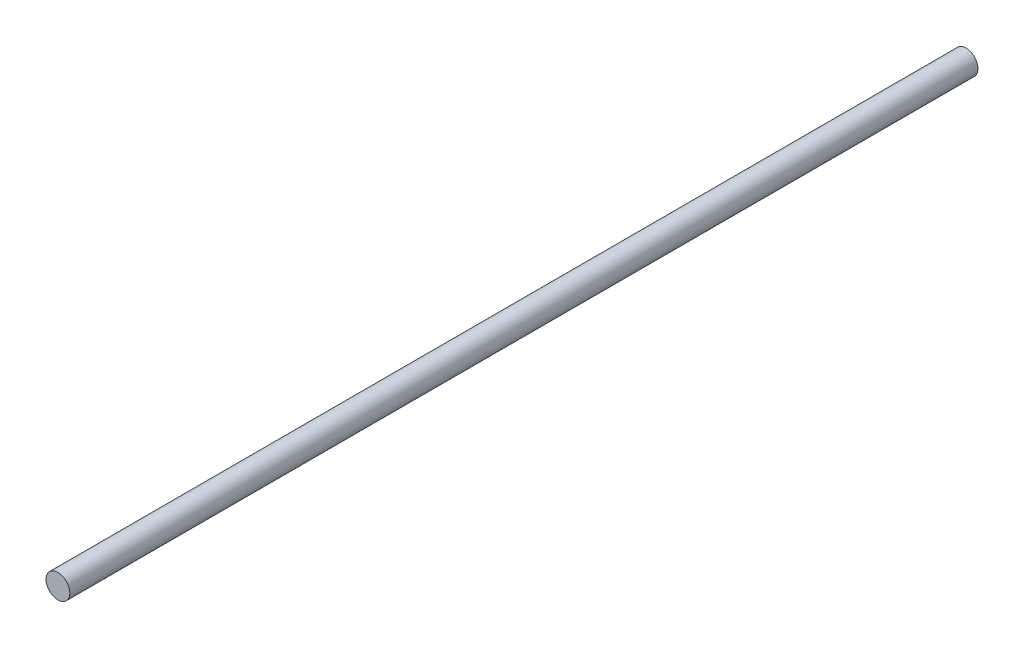
ISO-10303-21;
HEADER;
FILE_DESCRIPTION(('STEP AP214'),'2;1');
FILE_NAME('part.step','',(''),(''),'','','');
FILE_SCHEMA(('AUTOMOTIVE_DESIGN { 1 0 10303 214 1 1 1 1 }'));
ENDSEC;
DATA;
#1=APPLICATION_CONTEXT('core data for automotive mechanical design processes');
#2=APPLICATION_PROTOCOL_DEFINITION('international standard','automotive_design',2000,#1);
#3=PRODUCT_CONTEXT('',#1,'mechanical');
#4=PRODUCT('Part','Part','',(#3));
#5=PRODUCT_RELATED_PRODUCT_CATEGORY('part','',(#4));
#6=PRODUCT_DEFINITION_FORMATION('','',#4);
#7=PRODUCT_DEFINITION_CONTEXT('part definition',#1,'design');
#8=PRODUCT_DEFINITION('design','',#6,#7);
#9=PRODUCT_DEFINITION_SHAPE('','',#8);
#10=(LENGTH_UNIT() NAMED_UNIT(*) SI_UNIT(.MILLI.,.METRE.));
#11=(NAMED_UNIT(*) PLANE_ANGLE_UNIT() SI_UNIT($,.RADIAN.));
#12=(NAMED_UNIT(*) SI_UNIT($,.STERADIAN.) SOLID_ANGLE_UNIT());
#13=UNCERTAINTY_MEASURE_WITH_UNIT(LENGTH_MEASURE(1.E-05),#10,'distance_accuracy_value','');
#14=(GEOMETRIC_REPRESENTATION_CONTEXT(3) GLOBAL_UNCERTAINTY_ASSIGNED_CONTEXT((#13)) GLOBAL_UNIT_ASSIGNED_CONTEXT((#10,
#11,#12)) REPRESENTATION_CONTEXT('',''));
#15=CARTESIAN_POINT('',(0.,0.,0.));
#16=DIRECTION('',(0.,0.,1.));
#17=DIRECTION('',(1.,0.,0.));
#18=AXIS2_PLACEMENT_3D('',#15,#16,#17);
#19=CARTESIAN_POINT('',(0.,0.,23.8125));
#20=DIRECTION('',(0.,0.,-1.));
#21=DIRECTION('',(-1.,0.,0.));
#22=AXIS2_PLACEMENT_3D('',#19,#20,#21);
#23=CYLINDRICAL_SURFACE('',#22,0.625);
#24=CARTESIAN_POINT('',(0.,0.,23.8125));
#25=DIRECTION('',(0.,0.,1.));
#26=DIRECTION('',(1.,0.,0.));
#27=AXIS2_PLACEMENT_3D('',#24,#25,#26);
#28=CIRCLE('',#27,0.625);
#29=CARTESIAN_POINT('',(0.625,0.,23.8125));
#30=VERTEX_POINT('',#29);
#31=EDGE_CURVE('E10',#30,#30,#28,.T.);
#32=ORIENTED_EDGE('',*,*,#31,.F.);
#33=EDGE_LOOP('',(#32));
#34=FACE_BOUND('',#33,.T.);
#35=CARTESIAN_POINT('',(0.,0.,-23.8125));
#36=DIRECTION('',(0.,0.,1.));
#37=DIRECTION('',(1.,0.,0.));
#38=AXIS2_PLACEMENT_3D('',#35,#36,#37);
#39=CIRCLE('',#38,0.625);
#40=CARTESIAN_POINT('',(0.625,0.,-23.8125));
#41=VERTEX_POINT('',#40);
#42=EDGE_CURVE('E36',#41,#41,#39,.T.);
#43=ORIENTED_EDGE('',*,*,#42,.T.);
#44=EDGE_LOOP('',(#43));
#45=FACE_BOUND('',#44,.T.);
#46=ADVANCED_FACE('F30',(#34,#45),#23,.T.);
#47=CARTESIAN_POINT('',(0.,0.,23.8125));
#48=DIRECTION('',(0.,0.,1.));
#49=DIRECTION('',(1.,0.,0.));
#50=AXIS2_PLACEMENT_3D('',#47,#48,#49);
#51=PLANE('',#50);
#52=ORIENTED_EDGE('',*,*,#31,.T.);
#53=EDGE_LOOP('',(#52));
#54=FACE_BOUND('',#53,.T.);
#55=ADVANCED_FACE('F45',(#54),#51,.T.);
#56=CARTESIAN_POINT('',(0.,0.,-23.8125));
#57=DIRECTION('',(0.,0.,1.));
#58=DIRECTION('',(1.,0.,0.));
#59=AXIS2_PLACEMENT_3D('',#56,#57,#58);
#60=PLANE('',#59);
#61=ORIENTED_EDGE('',*,*,#42,.F.);
#62=EDGE_LOOP('',(#61));
#63=FACE_BOUND('',#62,.T.);
#64=ADVANCED_FACE('F43',(#63),#60,.F.);
#65=CLOSED_SHELL('',(#46,#55,#64));
#66=MANIFOLD_SOLID_BREP('B2',#65);
#67=ADVANCED_BREP_SHAPE_REPRESENTATION('',(#18,#66),#14);
#68=SHAPE_DEFINITION_REPRESENTATION(#9,#67);
ENDSEC;
END-ISO-10303-21;
